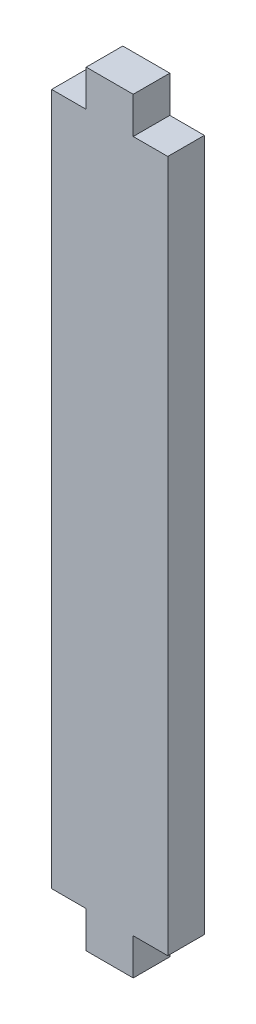
ISO-10303-21;
HEADER;
FILE_DESCRIPTION(('STEP AP214'),'2;1');
FILE_NAME('part.step','',(''),(''),'','','');
FILE_SCHEMA(('AUTOMOTIVE_DESIGN { 1 0 10303 214 1 1 1 1 }'));
ENDSEC;
DATA;
#1=APPLICATION_CONTEXT('core data for automotive mechanical design processes');
#2=APPLICATION_PROTOCOL_DEFINITION('international standard','automotive_design',2000,#1);
#3=PRODUCT_CONTEXT('',#1,'mechanical');
#4=PRODUCT('Part','Part','',(#3));
#5=PRODUCT_RELATED_PRODUCT_CATEGORY('part','',(#4));
#6=PRODUCT_DEFINITION_FORMATION('','',#4);
#7=PRODUCT_DEFINITION_CONTEXT('part definition',#1,'design');
#8=PRODUCT_DEFINITION('design','',#6,#7);
#9=PRODUCT_DEFINITION_SHAPE('','',#8);
#10=(LENGTH_UNIT() NAMED_UNIT(*) SI_UNIT(.MILLI.,.METRE.));
#11=(NAMED_UNIT(*) PLANE_ANGLE_UNIT() SI_UNIT($,.RADIAN.));
#12=(NAMED_UNIT(*) SI_UNIT($,.STERADIAN.) SOLID_ANGLE_UNIT());
#13=UNCERTAINTY_MEASURE_WITH_UNIT(LENGTH_MEASURE(1.E-05),#10,'distance_accuracy_value','');
#14=(GEOMETRIC_REPRESENTATION_CONTEXT(3) GLOBAL_UNCERTAINTY_ASSIGNED_CONTEXT((#13)) GLOBAL_UNIT_ASSIGNED_CONTEXT((#10,
#11,#12)) REPRESENTATION_CONTEXT('',''));
#15=CARTESIAN_POINT('',(0.,0.,0.));
#16=DIRECTION('',(0.,0.,1.));
#17=DIRECTION('',(1.,0.,0.));
#18=AXIS2_PLACEMENT_3D('',#15,#16,#17);
#19=CARTESIAN_POINT('',(2.04064,-30.04064,0.));
#20=DIRECTION('',(0.,-1.,0.));
#21=DIRECTION('',(0.,0.,-1.));
#22=AXIS2_PLACEMENT_3D('',#19,#20,#21);
#23=PLANE('',#22);
#24=DIRECTION('',(1.,0.,0.));
#25=VECTOR('',#24,1.);
#26=CARTESIAN_POINT('',(2.04064,-30.04064,3.175));
#27=LINE('',#26,#25);
#28=CARTESIAN_POINT('',(2.04064,-30.04064,3.175));
#29=VERTEX_POINT('',#28);
#30=CARTESIAN_POINT('',(5.04064,-30.04064,3.175));
#31=VERTEX_POINT('',#30);
#32=EDGE_CURVE('E172',#29,#31,#27,.T.);
#33=ORIENTED_EDGE('',*,*,#32,.F.);
#34=DIRECTION('',(0.,0.,1.));
#35=VECTOR('',#34,1.);
#36=CARTESIAN_POINT('',(2.04064,-30.04064,0.));
#37=LINE('',#36,#35);
#38=CARTESIAN_POINT('',(2.04064,-30.04064,0.));
#39=VERTEX_POINT('',#38);
#40=EDGE_CURVE('E11',#39,#29,#37,.T.);
#41=ORIENTED_EDGE('',*,*,#40,.F.);
#42=DIRECTION('',(1.,0.,0.));
#43=VECTOR('',#42,1.);
#44=CARTESIAN_POINT('',(2.04064,-30.04064,0.));
#45=LINE('',#44,#43);
#46=CARTESIAN_POINT('',(5.04064,-30.04064,0.));
#47=VERTEX_POINT('',#46);
#48=EDGE_CURVE('E216',#39,#47,#45,.T.);
#49=ORIENTED_EDGE('',*,*,#48,.T.);
#50=DIRECTION('',(0.,0.,1.));
#51=VECTOR('',#50,1.);
#52=CARTESIAN_POINT('',(5.04064,-30.04064,0.));
#53=LINE('',#52,#51);
#54=EDGE_CURVE('E49',#47,#31,#53,.T.);
#55=ORIENTED_EDGE('',*,*,#54,.T.);
#56=EDGE_LOOP('',(#33,#41,#49,#55));
#57=FACE_BOUND('',#56,.T.);
#58=ADVANCED_FACE('F45',(#57),#23,.T.);
#59=CARTESIAN_POINT('',(2.04064,-33.21564,0.));
#60=DIRECTION('',(1.,0.,0.));
#61=DIRECTION('',(0.,0.,-1.));
#62=AXIS2_PLACEMENT_3D('',#59,#60,#61);
#63=PLANE('',#62);
#64=DIRECTION('',(0.,1.,0.));
#65=VECTOR('',#64,1.);
#66=CARTESIAN_POINT('',(2.04064,-33.21564,3.175));
#67=LINE('',#66,#65);
#68=CARTESIAN_POINT('',(2.04064,-33.21564,3.175));
#69=VERTEX_POINT('',#68);
#70=EDGE_CURVE('E213',#69,#29,#67,.T.);
#71=ORIENTED_EDGE('',*,*,#70,.F.);
#72=DIRECTION('',(0.,0.,1.));
#73=VECTOR('',#72,1.);
#74=CARTESIAN_POINT('',(2.04064,-33.21564,0.));
#75=LINE('',#74,#73);
#76=CARTESIAN_POINT('',(2.04064,-33.21564,0.));
#77=VERTEX_POINT('',#76);
#78=EDGE_CURVE('E56',#77,#69,#75,.T.);
#79=ORIENTED_EDGE('',*,*,#78,.F.);
#80=DIRECTION('',(0.,1.,0.));
#81=VECTOR('',#80,1.);
#82=CARTESIAN_POINT('',(2.04064,-33.21564,0.));
#83=LINE('',#82,#81);
#84=EDGE_CURVE('E158',#77,#39,#83,.T.);
#85=ORIENTED_EDGE('',*,*,#84,.T.);
#86=ORIENTED_EDGE('',*,*,#40,.T.);
#87=EDGE_LOOP('',(#71,#79,#85,#86));
#88=FACE_BOUND('',#87,.T.);
#89=ADVANCED_FACE('F246',(#88),#63,.T.);
#90=CARTESIAN_POINT('',(-2.04064,-33.21564,0.));
#91=DIRECTION('',(0.,-1.,0.));
#92=DIRECTION('',(0.,0.,-1.));
#93=AXIS2_PLACEMENT_3D('',#90,#91,#92);
#94=PLANE('',#93);
#95=DIRECTION('',(1.,0.,0.));
#96=VECTOR('',#95,1.);
#97=CARTESIAN_POINT('',(-2.04064,-33.21564,3.175));
#98=LINE('',#97,#96);
#99=CARTESIAN_POINT('',(-2.04064,-33.21564,3.175));
#100=VERTEX_POINT('',#99);
#101=EDGE_CURVE('E145',#100,#69,#98,.T.);
#102=ORIENTED_EDGE('',*,*,#101,.F.);
#103=DIRECTION('',(0.,0.,1.));
#104=VECTOR('',#103,1.);
#105=CARTESIAN_POINT('',(-2.04064,-33.21564,0.));
#106=LINE('',#105,#104);
#107=CARTESIAN_POINT('',(-2.04064,-33.21564,0.));
#108=VERTEX_POINT('',#107);
#109=EDGE_CURVE('E140',#108,#100,#106,.T.);
#110=ORIENTED_EDGE('',*,*,#109,.F.);
#111=DIRECTION('',(1.,0.,0.));
#112=VECTOR('',#111,1.);
#113=CARTESIAN_POINT('',(-2.04064,-33.21564,0.));
#114=LINE('',#113,#112);
#115=EDGE_CURVE('E143',#108,#77,#114,.T.);
#116=ORIENTED_EDGE('',*,*,#115,.T.);
#117=ORIENTED_EDGE('',*,*,#78,.T.);
#118=EDGE_LOOP('',(#102,#110,#116,#117));
#119=FACE_BOUND('',#118,.T.);
#120=ADVANCED_FACE('F142',(#119),#94,.T.);
#121=CARTESIAN_POINT('',(-2.04064,-30.04064,0.));
#122=DIRECTION('',(-1.,0.,0.));
#123=DIRECTION('',(0.,0.,1.));
#124=AXIS2_PLACEMENT_3D('',#121,#122,#123);
#125=PLANE('',#124);
#126=DIRECTION('',(0.,-1.,0.));
#127=VECTOR('',#126,1.);
#128=CARTESIAN_POINT('',(-2.04064,-30.04064,3.175));
#129=LINE('',#128,#127);
#130=CARTESIAN_POINT('',(-2.04064,-30.04064,3.175));
#131=VERTEX_POINT('',#130);
#132=EDGE_CURVE('E208',#131,#100,#129,.T.);
#133=ORIENTED_EDGE('',*,*,#132,.F.);
#134=DIRECTION('',(0.,0.,1.));
#135=VECTOR('',#134,1.);
#136=CARTESIAN_POINT('',(-2.04064,-30.04064,0.));
#137=LINE('',#136,#135);
#138=CARTESIAN_POINT('',(-2.04064,-30.04064,0.));
#139=VERTEX_POINT('',#138);
#140=EDGE_CURVE('E151',#139,#131,#137,.T.);
#141=ORIENTED_EDGE('',*,*,#140,.F.);
#142=DIRECTION('',(0.,-1.,0.));
#143=VECTOR('',#142,1.);
#144=CARTESIAN_POINT('',(-2.04064,-30.04064,0.));
#145=LINE('',#144,#143);
#146=EDGE_CURVE('E156',#139,#108,#145,.T.);
#147=ORIENTED_EDGE('',*,*,#146,.T.);
#148=ORIENTED_EDGE('',*,*,#109,.T.);
#149=EDGE_LOOP('',(#133,#141,#147,#148));
#150=FACE_BOUND('',#149,.T.);
#151=ADVANCED_FACE('F161',(#150),#125,.T.);
#152=CARTESIAN_POINT('',(-5.04064,-30.04064,0.));
#153=DIRECTION('',(0.,-1.,0.));
#154=DIRECTION('',(0.,0.,-1.));
#155=AXIS2_PLACEMENT_3D('',#152,#153,#154);
#156=PLANE('',#155);
#157=DIRECTION('',(1.,0.,0.));
#158=VECTOR('',#157,1.);
#159=CARTESIAN_POINT('',(-5.04064,-30.04064,3.175));
#160=LINE('',#159,#158);
#161=CARTESIAN_POINT('',(-5.04064,-30.04064,3.175));
#162=VERTEX_POINT('',#161);
#163=EDGE_CURVE('E204',#162,#131,#160,.T.);
#164=ORIENTED_EDGE('',*,*,#163,.F.);
#165=DIRECTION('',(0.,0.,1.));
#166=VECTOR('',#165,1.);
#167=CARTESIAN_POINT('',(-5.04064,-30.04064,0.));
#168=LINE('',#167,#166);
#169=CARTESIAN_POINT('',(-5.04064,-30.04064,0.));
#170=VERTEX_POINT('',#169);
#171=EDGE_CURVE('E222',#170,#162,#168,.T.);
#172=ORIENTED_EDGE('',*,*,#171,.F.);
#173=DIRECTION('',(1.,0.,0.));
#174=VECTOR('',#173,1.);
#175=CARTESIAN_POINT('',(-5.04064,-30.04064,0.));
#176=LINE('',#175,#174);
#177=EDGE_CURVE('E163',#170,#139,#176,.T.);
#178=ORIENTED_EDGE('',*,*,#177,.T.);
#179=ORIENTED_EDGE('',*,*,#140,.T.);
#180=EDGE_LOOP('',(#164,#172,#178,#179));
#181=FACE_BOUND('',#180,.T.);
#182=ADVANCED_FACE('F258',(#181),#156,.T.);
#183=CARTESIAN_POINT('',(-5.04064,30.04064,0.));
#184=DIRECTION('',(-1.,0.,0.));
#185=DIRECTION('',(0.,-1.,0.));
#186=AXIS2_PLACEMENT_3D('',#183,#184,#185);
#187=PLANE('',#186);
#188=DIRECTION('',(0.,-1.,0.));
#189=VECTOR('',#188,1.);
#190=CARTESIAN_POINT('',(-5.04064,30.04064,3.175));
#191=LINE('',#190,#189);
#192=CARTESIAN_POINT('',(-5.04064,30.04064,3.175));
#193=VERTEX_POINT('',#192);
#194=EDGE_CURVE('E200',#193,#162,#191,.T.);
#195=ORIENTED_EDGE('',*,*,#194,.F.);
#196=DIRECTION('',(0.,0.,1.));
#197=VECTOR('',#196,1.);
#198=CARTESIAN_POINT('',(-5.04064,30.04064,0.));
#199=LINE('',#198,#197);
#200=CARTESIAN_POINT('',(-5.04064,30.04064,0.));
#201=VERTEX_POINT('',#200);
#202=EDGE_CURVE('E225',#201,#193,#199,.T.);
#203=ORIENTED_EDGE('',*,*,#202,.F.);
#204=DIRECTION('',(0.,-1.,0.));
#205=VECTOR('',#204,1.);
#206=CARTESIAN_POINT('',(-5.04064,30.04064,0.));
#207=LINE('',#206,#205);
#208=EDGE_CURVE('E166',#201,#170,#207,.T.);
#209=ORIENTED_EDGE('',*,*,#208,.T.);
#210=ORIENTED_EDGE('',*,*,#171,.T.);
#211=EDGE_LOOP('',(#195,#203,#209,#210));
#212=FACE_BOUND('',#211,.T.);
#213=ADVANCED_FACE('F261',(#212),#187,.T.);
#214=CARTESIAN_POINT('',(-2.04064,30.04064,0.));
#215=DIRECTION('',(0.,1.,0.));
#216=DIRECTION('',(0.,0.,1.));
#217=AXIS2_PLACEMENT_3D('',#214,#215,#216);
#218=PLANE('',#217);
#219=DIRECTION('',(-1.,0.,0.));
#220=VECTOR('',#219,1.);
#221=CARTESIAN_POINT('',(-2.04064,30.04064,3.175));
#222=LINE('',#221,#220);
#223=CARTESIAN_POINT('',(-2.04064,30.04064,3.175));
#224=VERTEX_POINT('',#223);
#225=EDGE_CURVE('E196',#224,#193,#222,.T.);
#226=ORIENTED_EDGE('',*,*,#225,.F.);
#227=DIRECTION('',(0.,0.,1.));
#228=VECTOR('',#227,1.);
#229=CARTESIAN_POINT('',(-2.04064,30.04064,0.));
#230=LINE('',#229,#228);
#231=CARTESIAN_POINT('',(-2.04064,30.04064,0.));
#232=VERTEX_POINT('',#231);
#233=EDGE_CURVE('E228',#232,#224,#230,.T.);
#234=ORIENTED_EDGE('',*,*,#233,.F.);
#235=DIRECTION('',(-1.,0.,0.));
#236=VECTOR('',#235,1.);
#237=CARTESIAN_POINT('',(-2.04064,30.04064,0.));
#238=LINE('',#237,#236);
#239=EDGE_CURVE('E410',#232,#201,#238,.T.);
#240=ORIENTED_EDGE('',*,*,#239,.T.);
#241=ORIENTED_EDGE('',*,*,#202,.T.);
#242=EDGE_LOOP('',(#226,#234,#240,#241));
#243=FACE_BOUND('',#242,.T.);
#244=ADVANCED_FACE('F265',(#243),#218,.T.);
#245=CARTESIAN_POINT('',(-2.04064,33.21564,0.));
#246=DIRECTION('',(-1.,0.,0.));
#247=DIRECTION('',(0.,0.,1.));
#248=AXIS2_PLACEMENT_3D('',#245,#246,#247);
#249=PLANE('',#248);
#250=DIRECTION('',(0.,-1.,0.));
#251=VECTOR('',#250,1.);
#252=CARTESIAN_POINT('',(-2.04064,33.21564,3.175));
#253=LINE('',#252,#251);
#254=CARTESIAN_POINT('',(-2.04064,33.21564,3.175));
#255=VERTEX_POINT('',#254);
#256=EDGE_CURVE('E192',#255,#224,#253,.T.);
#257=ORIENTED_EDGE('',*,*,#256,.F.);
#258=DIRECTION('',(0.,0.,1.));
#259=VECTOR('',#258,1.);
#260=CARTESIAN_POINT('',(-2.04064,33.21564,0.));
#261=LINE('',#260,#259);
#262=CARTESIAN_POINT('',(-2.04064,33.21564,0.));
#263=VERTEX_POINT('',#262);
#264=EDGE_CURVE('E231',#263,#255,#261,.T.);
#265=ORIENTED_EDGE('',*,*,#264,.F.);
#266=DIRECTION('',(0.,-1.,0.));
#267=VECTOR('',#266,1.);
#268=CARTESIAN_POINT('',(-2.04064,33.21564,0.));
#269=LINE('',#268,#267);
#270=EDGE_CURVE('E416',#263,#232,#269,.T.);
#271=ORIENTED_EDGE('',*,*,#270,.T.);
#272=ORIENTED_EDGE('',*,*,#233,.T.);
#273=EDGE_LOOP('',(#257,#265,#271,#272));
#274=FACE_BOUND('',#273,.T.);
#275=ADVANCED_FACE('F269',(#274),#249,.T.);
#276=CARTESIAN_POINT('',(2.04064,33.21564,0.));
#277=DIRECTION('',(0.,1.,0.));
#278=DIRECTION('',(0.,0.,1.));
#279=AXIS2_PLACEMENT_3D('',#276,#277,#278);
#280=PLANE('',#279);
#281=DIRECTION('',(-1.,0.,0.));
#282=VECTOR('',#281,1.);
#283=CARTESIAN_POINT('',(2.04064,33.21564,3.175));
#284=LINE('',#283,#282);
#285=CARTESIAN_POINT('',(2.04064,33.21564,3.175));
#286=VERTEX_POINT('',#285);
#287=EDGE_CURVE('E188',#286,#255,#284,.T.);
#288=ORIENTED_EDGE('',*,*,#287,.F.);
#289=DIRECTION('',(0.,0.,1.));
#290=VECTOR('',#289,1.);
#291=CARTESIAN_POINT('',(2.04064,33.21564,0.));
#292=LINE('',#291,#290);
#293=CARTESIAN_POINT('',(2.04064,33.21564,0.));
#294=VERTEX_POINT('',#293);
#295=EDGE_CURVE('E234',#294,#286,#292,.T.);
#296=ORIENTED_EDGE('',*,*,#295,.F.);
#297=DIRECTION('',(-1.,0.,0.));
#298=VECTOR('',#297,1.);
#299=CARTESIAN_POINT('',(2.04064,33.21564,0.));
#300=LINE('',#299,#298);
#301=EDGE_CURVE('E403',#294,#263,#300,.T.);
#302=ORIENTED_EDGE('',*,*,#301,.T.);
#303=ORIENTED_EDGE('',*,*,#264,.T.);
#304=EDGE_LOOP('',(#288,#296,#302,#303));
#305=FACE_BOUND('',#304,.T.);
#306=ADVANCED_FACE('F273',(#305),#280,.T.);
#307=CARTESIAN_POINT('',(2.04064,30.04064,0.));
#308=DIRECTION('',(1.,0.,0.));
#309=DIRECTION('',(0.,0.,-1.));
#310=AXIS2_PLACEMENT_3D('',#307,#308,#309);
#311=PLANE('',#310);
#312=DIRECTION('',(0.,1.,0.));
#313=VECTOR('',#312,1.);
#314=CARTESIAN_POINT('',(2.04064,30.04064,3.175));
#315=LINE('',#314,#313);
#316=CARTESIAN_POINT('',(2.04064,30.04064,3.175));
#317=VERTEX_POINT('',#316);
#318=EDGE_CURVE('E184',#317,#286,#315,.T.);
#319=ORIENTED_EDGE('',*,*,#318,.F.);
#320=DIRECTION('',(0.,0.,1.));
#321=VECTOR('',#320,1.);
#322=CARTESIAN_POINT('',(2.04064,30.04064,0.));
#323=LINE('',#322,#321);
#324=CARTESIAN_POINT('',(2.04064,30.04064,0.));
#325=VERTEX_POINT('',#324);
#326=EDGE_CURVE('E237',#325,#317,#323,.T.);
#327=ORIENTED_EDGE('',*,*,#326,.F.);
#328=DIRECTION('',(0.,1.,0.));
#329=VECTOR('',#328,1.);
#330=CARTESIAN_POINT('',(2.04064,30.04064,0.));
#331=LINE('',#330,#329);
#332=EDGE_CURVE('E399',#325,#294,#331,.T.);
#333=ORIENTED_EDGE('',*,*,#332,.T.);
#334=ORIENTED_EDGE('',*,*,#295,.T.);
#335=EDGE_LOOP('',(#319,#327,#333,#334));
#336=FACE_BOUND('',#335,.T.);
#337=ADVANCED_FACE('F277',(#336),#311,.T.);
#338=CARTESIAN_POINT('',(5.04064,30.04064,0.));
#339=DIRECTION('',(0.,1.,0.));
#340=DIRECTION('',(0.,0.,1.));
#341=AXIS2_PLACEMENT_3D('',#338,#339,#340);
#342=PLANE('',#341);
#343=DIRECTION('',(-1.,0.,0.));
#344=VECTOR('',#343,1.);
#345=CARTESIAN_POINT('',(5.04064,30.04064,3.175));
#346=LINE('',#345,#344);
#347=CARTESIAN_POINT('',(5.04064,30.04064,3.175));
#348=VERTEX_POINT('',#347);
#349=EDGE_CURVE('E180',#348,#317,#346,.T.);
#350=ORIENTED_EDGE('',*,*,#349,.F.);
#351=DIRECTION('',(0.,0.,1.));
#352=VECTOR('',#351,1.);
#353=CARTESIAN_POINT('',(5.04064,30.04064,0.));
#354=LINE('',#353,#352);
#355=CARTESIAN_POINT('',(5.04064,30.04064,0.));
#356=VERTEX_POINT('',#355);
#357=EDGE_CURVE('E239',#356,#348,#354,.T.);
#358=ORIENTED_EDGE('',*,*,#357,.F.);
#359=DIRECTION('',(-1.,0.,0.));
#360=VECTOR('',#359,1.);
#361=CARTESIAN_POINT('',(5.04064,30.04064,0.));
#362=LINE('',#361,#360);
#363=EDGE_CURVE('E425',#356,#325,#362,.T.);
#364=ORIENTED_EDGE('',*,*,#363,.T.);
#365=ORIENTED_EDGE('',*,*,#326,.T.);
#366=EDGE_LOOP('',(#350,#358,#364,#365));
#367=FACE_BOUND('',#366,.T.);
#368=ADVANCED_FACE('F281',(#367),#342,.T.);
#369=CARTESIAN_POINT('',(5.04064,-30.04064,0.));
#370=DIRECTION('',(1.,0.,0.));
#371=DIRECTION('',(0.,1.,0.));
#372=AXIS2_PLACEMENT_3D('',#369,#370,#371);
#373=PLANE('',#372);
#374=DIRECTION('',(0.,1.,0.));
#375=VECTOR('',#374,1.);
#376=CARTESIAN_POINT('',(5.04064,-30.04064,3.175));
#377=LINE('',#376,#375);
#378=EDGE_CURVE('E176',#31,#348,#377,.T.);
#379=ORIENTED_EDGE('',*,*,#378,.F.);
#380=ORIENTED_EDGE('',*,*,#54,.F.);
#381=DIRECTION('',(0.,1.,0.));
#382=VECTOR('',#381,1.);
#383=CARTESIAN_POINT('',(5.04064,-30.04064,0.));
#384=LINE('',#383,#382);
#385=EDGE_CURVE('E428',#47,#356,#384,.T.);
#386=ORIENTED_EDGE('',*,*,#385,.T.);
#387=ORIENTED_EDGE('',*,*,#357,.T.);
#388=EDGE_LOOP('',(#379,#380,#386,#387));
#389=FACE_BOUND('',#388,.T.);
#390=ADVANCED_FACE('F243',(#389),#373,.T.);
#391=CARTESIAN_POINT('',(0.,0.,3.175));
#392=DIRECTION('',(0.,0.,1.));
#393=DIRECTION('',(1.,0.,0.));
#394=AXIS2_PLACEMENT_3D('',#391,#392,#393);
#395=PLANE('',#394);
#396=ORIENTED_EDGE('',*,*,#32,.T.);
#397=ORIENTED_EDGE('',*,*,#378,.T.);
#398=ORIENTED_EDGE('',*,*,#349,.T.);
#399=ORIENTED_EDGE('',*,*,#318,.T.);
#400=ORIENTED_EDGE('',*,*,#287,.T.);
#401=ORIENTED_EDGE('',*,*,#256,.T.);
#402=ORIENTED_EDGE('',*,*,#225,.T.);
#403=ORIENTED_EDGE('',*,*,#194,.T.);
#404=ORIENTED_EDGE('',*,*,#163,.T.);
#405=ORIENTED_EDGE('',*,*,#132,.T.);
#406=ORIENTED_EDGE('',*,*,#101,.T.);
#407=ORIENTED_EDGE('',*,*,#70,.T.);
#408=EDGE_LOOP('',(#396,#397,#398,#399,#400,#401,#402,#403,#404,#405,#406,#407));
#409=FACE_BOUND('',#408,.T.);
#410=ADVANCED_FACE('F245',(#409),#395,.T.);
#411=CARTESIAN_POINT('',(0.,0.,0.));
#412=DIRECTION('',(0.,0.,1.));
#413=DIRECTION('',(1.,0.,0.));
#414=AXIS2_PLACEMENT_3D('',#411,#412,#413);
#415=PLANE('',#414);
#416=ORIENTED_EDGE('',*,*,#48,.F.);
#417=ORIENTED_EDGE('',*,*,#84,.F.);
#418=ORIENTED_EDGE('',*,*,#115,.F.);
#419=ORIENTED_EDGE('',*,*,#146,.F.);
#420=ORIENTED_EDGE('',*,*,#177,.F.);
#421=ORIENTED_EDGE('',*,*,#208,.F.);
#422=ORIENTED_EDGE('',*,*,#239,.F.);
#423=ORIENTED_EDGE('',*,*,#270,.F.);
#424=ORIENTED_EDGE('',*,*,#301,.F.);
#425=ORIENTED_EDGE('',*,*,#332,.F.);
#426=ORIENTED_EDGE('',*,*,#363,.F.);
#427=ORIENTED_EDGE('',*,*,#385,.F.);
#428=EDGE_LOOP('',(#416,#417,#418,#419,#420,#421,#422,#423,#424,#425,#426,#427));
#429=FACE_BOUND('',#428,.T.);
#430=ADVANCED_FACE('F47',(#429),#415,.F.);
#431=CLOSED_SHELL('',(#58,#89,#120,#151,#182,#213,#244,#275,#306,#337,#368,#390,#410,#430));
#432=MANIFOLD_SOLID_BREP('B2',#431);
#433=ADVANCED_BREP_SHAPE_REPRESENTATION('',(#18,#432),#14);
#434=SHAPE_DEFINITION_REPRESENTATION(#9,#433);
ENDSEC;
END-ISO-10303-21;
